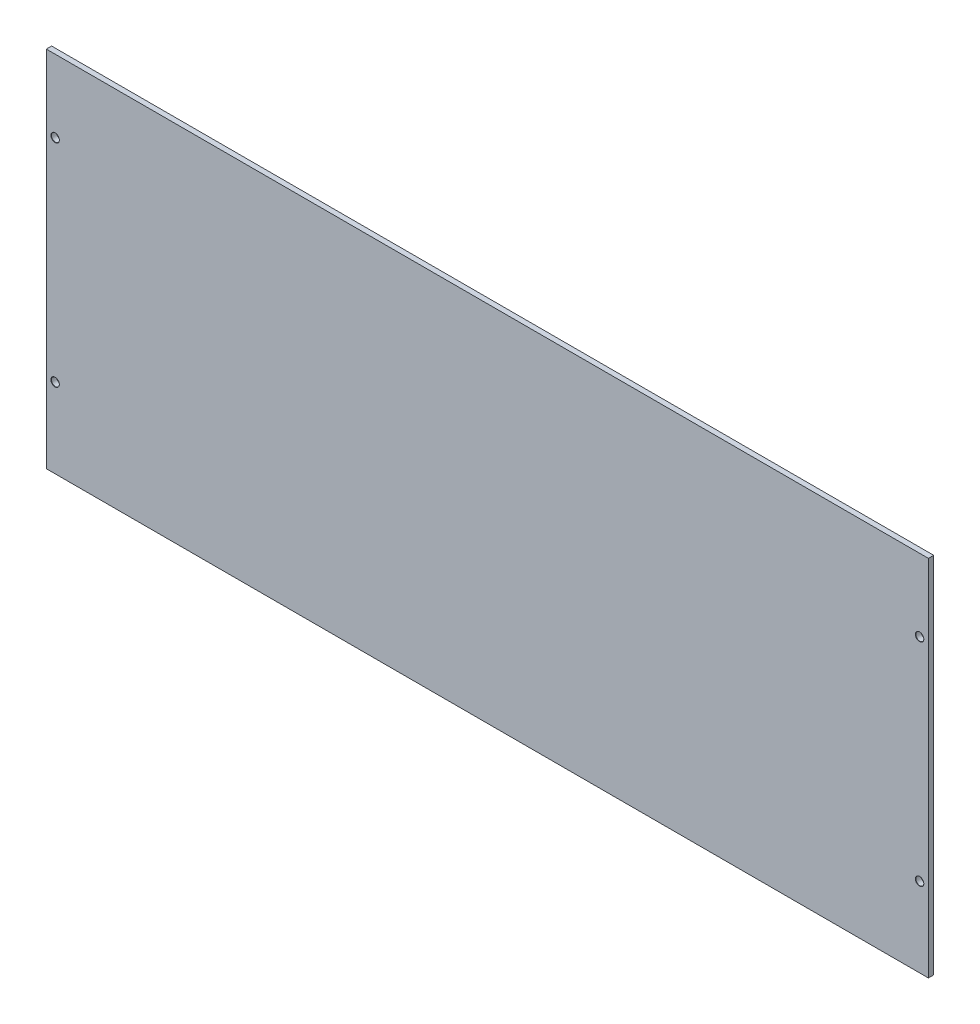
ISO-10303-21;
HEADER;
FILE_DESCRIPTION(('STEP AP214'),'2;1');
FILE_NAME('part.step','',(''),(''),'','','');
FILE_SCHEMA(('AUTOMOTIVE_DESIGN { 1 0 10303 214 1 1 1 1 }'));
ENDSEC;
DATA;
#1=APPLICATION_CONTEXT('core data for automotive mechanical design processes');
#2=APPLICATION_PROTOCOL_DEFINITION('international standard','automotive_design',2000,#1);
#3=PRODUCT_CONTEXT('',#1,'mechanical');
#4=PRODUCT('Part','Part','',(#3));
#5=PRODUCT_RELATED_PRODUCT_CATEGORY('part','',(#4));
#6=PRODUCT_DEFINITION_FORMATION('','',#4);
#7=PRODUCT_DEFINITION_CONTEXT('part definition',#1,'design');
#8=PRODUCT_DEFINITION('design','',#6,#7);
#9=PRODUCT_DEFINITION_SHAPE('','',#8);
#10=(LENGTH_UNIT() NAMED_UNIT(*) SI_UNIT(.MILLI.,.METRE.));
#11=(NAMED_UNIT(*) PLANE_ANGLE_UNIT() SI_UNIT($,.RADIAN.));
#12=(NAMED_UNIT(*) SI_UNIT($,.STERADIAN.) SOLID_ANGLE_UNIT());
#13=UNCERTAINTY_MEASURE_WITH_UNIT(LENGTH_MEASURE(1.E-05),#10,'distance_accuracy_value','');
#14=(GEOMETRIC_REPRESENTATION_CONTEXT(3) GLOBAL_UNCERTAINTY_ASSIGNED_CONTEXT((#13)) GLOBAL_UNIT_ASSIGNED_CONTEXT((#10,
#11,#12)) REPRESENTATION_CONTEXT('',''));
#15=CARTESIAN_POINT('',(0.,0.,0.));
#16=DIRECTION('',(0.,0.,1.));
#17=DIRECTION('',(1.,0.,0.));
#18=AXIS2_PLACEMENT_3D('',#15,#16,#17);
#19=CARTESIAN_POINT('',(0.,0.,3.));
#20=DIRECTION('',(1.,0.,0.));
#21=DIRECTION('',(0.,0.,-1.));
#22=AXIS2_PLACEMENT_3D('',#19,#20,#21);
#23=PLANE('',#22);
#24=DIRECTION('',(0.,-1.,0.));
#25=VECTOR('',#24,1.);
#26=CARTESIAN_POINT('',(0.,0.,0.));
#27=LINE('',#26,#25);
#28=CARTESIAN_POINT('',(0.,206.,0.));
#29=VERTEX_POINT('',#28);
#30=CARTESIAN_POINT('',(0.,0.,0.));
#31=VERTEX_POINT('',#30);
#32=EDGE_CURVE('E97',#29,#31,#27,.T.);
#33=ORIENTED_EDGE('',*,*,#32,.T.);
#34=DIRECTION('',(0.,0.,-1.));
#35=VECTOR('',#34,1.);
#36=CARTESIAN_POINT('',(0.,0.,3.));
#37=LINE('',#36,#35);
#38=CARTESIAN_POINT('',(0.,0.,3.));
#39=VERTEX_POINT('',#38);
#40=EDGE_CURVE('E11',#39,#31,#37,.T.);
#41=ORIENTED_EDGE('',*,*,#40,.F.);
#42=DIRECTION('',(0.,-1.,0.));
#43=VECTOR('',#42,1.);
#44=CARTESIAN_POINT('',(0.,0.,3.));
#45=LINE('',#44,#43);
#46=CARTESIAN_POINT('',(0.,206.,3.));
#47=VERTEX_POINT('',#46);
#48=EDGE_CURVE('E84',#47,#39,#45,.T.);
#49=ORIENTED_EDGE('',*,*,#48,.F.);
#50=DIRECTION('',(0.,0.,-1.));
#51=VECTOR('',#50,1.);
#52=CARTESIAN_POINT('',(0.,206.,3.));
#53=LINE('',#52,#51);
#54=EDGE_CURVE('E93',#47,#29,#53,.T.);
#55=ORIENTED_EDGE('',*,*,#54,.T.);
#56=EDGE_LOOP('',(#33,#41,#49,#55));
#57=FACE_BOUND('',#56,.T.);
#58=ADVANCED_FACE('F31',(#57),#23,.F.);
#59=CARTESIAN_POINT('',(0.,0.,3.));
#60=DIRECTION('',(0.,1.,0.));
#61=DIRECTION('',(0.,0.,1.));
#62=AXIS2_PLACEMENT_3D('',#59,#60,#61);
#63=PLANE('',#62);
#64=DIRECTION('',(1.,0.,0.));
#65=VECTOR('',#64,1.);
#66=CARTESIAN_POINT('',(0.,0.,0.));
#67=LINE('',#66,#65);
#68=CARTESIAN_POINT('',(500.,0.,0.));
#69=VERTEX_POINT('',#68);
#70=EDGE_CURVE('E88',#31,#69,#67,.T.);
#71=ORIENTED_EDGE('',*,*,#70,.T.);
#72=DIRECTION('',(0.,0.,-1.));
#73=VECTOR('',#72,1.);
#74=CARTESIAN_POINT('',(500.,0.,3.));
#75=LINE('',#74,#73);
#76=CARTESIAN_POINT('',(500.,0.,3.));
#77=VERTEX_POINT('',#76);
#78=EDGE_CURVE('E40',#77,#69,#75,.T.);
#79=ORIENTED_EDGE('',*,*,#78,.F.);
#80=DIRECTION('',(1.,0.,0.));
#81=VECTOR('',#80,1.);
#82=CARTESIAN_POINT('',(0.,0.,3.));
#83=LINE('',#82,#81);
#84=EDGE_CURVE('E79',#39,#77,#83,.T.);
#85=ORIENTED_EDGE('',*,*,#84,.F.);
#86=ORIENTED_EDGE('',*,*,#40,.T.);
#87=EDGE_LOOP('',(#71,#79,#85,#86));
#88=FACE_BOUND('',#87,.T.);
#89=ADVANCED_FACE('F87',(#88),#63,.F.);
#90=CARTESIAN_POINT('',(500.,0.,3.));
#91=DIRECTION('',(-1.,0.,0.));
#92=DIRECTION('',(0.,0.,1.));
#93=AXIS2_PLACEMENT_3D('',#90,#91,#92);
#94=PLANE('',#93);
#95=DIRECTION('',(0.,1.,0.));
#96=VECTOR('',#95,1.);
#97=CARTESIAN_POINT('',(500.,0.,0.));
#98=LINE('',#97,#96);
#99=CARTESIAN_POINT('',(500.,206.,0.));
#100=VERTEX_POINT('',#99);
#101=EDGE_CURVE('E66',#69,#100,#98,.T.);
#102=ORIENTED_EDGE('',*,*,#101,.T.);
#103=DIRECTION('',(0.,0.,-1.));
#104=VECTOR('',#103,1.);
#105=CARTESIAN_POINT('',(500.,206.,3.));
#106=LINE('',#105,#104);
#107=CARTESIAN_POINT('',(500.,206.,3.));
#108=VERTEX_POINT('',#107);
#109=EDGE_CURVE('E89',#108,#100,#106,.T.);
#110=ORIENTED_EDGE('',*,*,#109,.F.);
#111=DIRECTION('',(0.,1.,0.));
#112=VECTOR('',#111,1.);
#113=CARTESIAN_POINT('',(500.,0.,3.));
#114=LINE('',#113,#112);
#115=EDGE_CURVE('E82',#77,#108,#114,.T.);
#116=ORIENTED_EDGE('',*,*,#115,.F.);
#117=ORIENTED_EDGE('',*,*,#78,.T.);
#118=EDGE_LOOP('',(#102,#110,#116,#117));
#119=FACE_BOUND('',#118,.T.);
#120=ADVANCED_FACE('F91',(#119),#94,.F.);
#121=CARTESIAN_POINT('',(0.,206.,3.));
#122=DIRECTION('',(0.,-1.,0.));
#123=DIRECTION('',(0.,0.,-1.));
#124=AXIS2_PLACEMENT_3D('',#121,#122,#123);
#125=PLANE('',#124);
#126=DIRECTION('',(-1.,0.,0.));
#127=VECTOR('',#126,1.);
#128=CARTESIAN_POINT('',(0.,206.,0.));
#129=LINE('',#128,#127);
#130=EDGE_CURVE('E72',#100,#29,#129,.T.);
#131=ORIENTED_EDGE('',*,*,#130,.T.);
#132=ORIENTED_EDGE('',*,*,#54,.F.);
#133=DIRECTION('',(-1.,0.,0.));
#134=VECTOR('',#133,1.);
#135=CARTESIAN_POINT('',(0.,206.,3.));
#136=LINE('',#135,#134);
#137=EDGE_CURVE('E49',#108,#47,#136,.T.);
#138=ORIENTED_EDGE('',*,*,#137,.F.);
#139=ORIENTED_EDGE('',*,*,#109,.T.);
#140=EDGE_LOOP('',(#131,#132,#138,#139));
#141=FACE_BOUND('',#140,.T.);
#142=ADVANCED_FACE('F148',(#141),#125,.F.);
#143=CARTESIAN_POINT('',(0.,206.,3.));
#144=DIRECTION('',(0.,0.,-1.));
#145=DIRECTION('',(-1.,0.,0.));
#146=AXIS2_PLACEMENT_3D('',#143,#144,#145);
#147=PLANE('',#146);
#148=CARTESIAN_POINT('',(5.,165.,3.));
#149=DIRECTION('',(0.,0.,1.));
#150=DIRECTION('',(1.,0.,0.));
#151=AXIS2_PLACEMENT_3D('',#148,#149,#150);
#152=CIRCLE('',#151,2.4);
#153=CARTESIAN_POINT('',(7.4,165.,3.));
#154=VERTEX_POINT('',#153);
#155=EDGE_CURVE('E269',#154,#154,#152,.T.);
#156=ORIENTED_EDGE('',*,*,#155,.F.);
#157=EDGE_LOOP('',(#156));
#158=FACE_BOUND('',#157,.T.);
#159=CARTESIAN_POINT('',(5.,45.,3.));
#160=DIRECTION('',(0.,0.,1.));
#161=DIRECTION('',(1.,0.,0.));
#162=AXIS2_PLACEMENT_3D('',#159,#160,#161);
#163=CIRCLE('',#162,2.4);
#164=CARTESIAN_POINT('',(7.4,45.,3.));
#165=VERTEX_POINT('',#164);
#166=EDGE_CURVE('E122',#165,#165,#163,.T.);
#167=ORIENTED_EDGE('',*,*,#166,.F.);
#168=EDGE_LOOP('',(#167));
#169=FACE_BOUND('',#168,.T.);
#170=CARTESIAN_POINT('',(495.,45.,3.));
#171=DIRECTION('',(0.,0.,1.));
#172=DIRECTION('',(1.,0.,0.));
#173=AXIS2_PLACEMENT_3D('',#170,#171,#172);
#174=CIRCLE('',#173,2.40000000000001);
#175=CARTESIAN_POINT('',(497.4,45.,3.));
#176=VERTEX_POINT('',#175);
#177=EDGE_CURVE('E115',#176,#176,#174,.T.);
#178=ORIENTED_EDGE('',*,*,#177,.F.);
#179=EDGE_LOOP('',(#178));
#180=FACE_BOUND('',#179,.T.);
#181=CARTESIAN_POINT('',(495.,165.,3.));
#182=DIRECTION('',(0.,0.,1.));
#183=DIRECTION('',(1.,0.,0.));
#184=AXIS2_PLACEMENT_3D('',#181,#182,#183);
#185=CIRCLE('',#184,2.40000000000001);
#186=CARTESIAN_POINT('',(497.4,165.,3.));
#187=VERTEX_POINT('',#186);
#188=EDGE_CURVE('E111',#187,#187,#185,.T.);
#189=ORIENTED_EDGE('',*,*,#188,.F.);
#190=EDGE_LOOP('',(#189));
#191=FACE_BOUND('',#190,.T.);
#192=ORIENTED_EDGE('',*,*,#48,.T.);
#193=ORIENTED_EDGE('',*,*,#84,.T.);
#194=ORIENTED_EDGE('',*,*,#115,.T.);
#195=ORIENTED_EDGE('',*,*,#137,.T.);
#196=EDGE_LOOP('',(#192,#193,#194,#195));
#197=FACE_BOUND('',#196,.T.);
#198=ADVANCED_FACE('F80',(#158,#169,#180,#191,#197),#147,.F.);
#199=CARTESIAN_POINT('',(0.,206.,0.));
#200=DIRECTION('',(0.,0.,-1.));
#201=DIRECTION('',(-1.,0.,0.));
#202=AXIS2_PLACEMENT_3D('',#199,#200,#201);
#203=PLANE('',#202);
#204=CARTESIAN_POINT('',(5.,165.,0.));
#205=DIRECTION('',(0.,0.,-1.));
#206=DIRECTION('',(-1.,0.,0.));
#207=AXIS2_PLACEMENT_3D('',#204,#205,#206);
#208=CIRCLE('',#207,2.24999999999999);
#209=CARTESIAN_POINT('',(2.75000000000001,165.,0.));
#210=VERTEX_POINT('',#209);
#211=EDGE_CURVE('E34',#210,#210,#208,.T.);
#212=ORIENTED_EDGE('',*,*,#211,.F.);
#213=EDGE_LOOP('',(#212));
#214=FACE_BOUND('',#213,.T.);
#215=CARTESIAN_POINT('',(5.,45.,0.));
#216=DIRECTION('',(0.,0.,-1.));
#217=DIRECTION('',(-1.,0.,0.));
#218=AXIS2_PLACEMENT_3D('',#215,#216,#217);
#219=CIRCLE('',#218,2.24999999999999);
#220=CARTESIAN_POINT('',(2.75000000000001,45.,0.));
#221=VERTEX_POINT('',#220);
#222=EDGE_CURVE('E113',#221,#221,#219,.T.);
#223=ORIENTED_EDGE('',*,*,#222,.F.);
#224=EDGE_LOOP('',(#223));
#225=FACE_BOUND('',#224,.T.);
#226=CARTESIAN_POINT('',(495.,45.,0.));
#227=DIRECTION('',(0.,0.,-1.));
#228=DIRECTION('',(-1.,0.,0.));
#229=AXIS2_PLACEMENT_3D('',#226,#227,#228);
#230=CIRCLE('',#229,2.24999999999997);
#231=CARTESIAN_POINT('',(492.75,45.,0.));
#232=VERTEX_POINT('',#231);
#233=EDGE_CURVE('E109',#232,#232,#230,.T.);
#234=ORIENTED_EDGE('',*,*,#233,.F.);
#235=EDGE_LOOP('',(#234));
#236=FACE_BOUND('',#235,.T.);
#237=CARTESIAN_POINT('',(495.,165.,0.));
#238=DIRECTION('',(0.,0.,-1.));
#239=DIRECTION('',(-1.,0.,0.));
#240=AXIS2_PLACEMENT_3D('',#237,#238,#239);
#241=CIRCLE('',#240,2.24999999999997);
#242=CARTESIAN_POINT('',(492.75,165.,0.));
#243=VERTEX_POINT('',#242);
#244=EDGE_CURVE('E100',#243,#243,#241,.T.);
#245=ORIENTED_EDGE('',*,*,#244,.F.);
#246=EDGE_LOOP('',(#245));
#247=FACE_BOUND('',#246,.T.);
#248=ORIENTED_EDGE('',*,*,#32,.F.);
#249=ORIENTED_EDGE('',*,*,#130,.F.);
#250=ORIENTED_EDGE('',*,*,#101,.F.);
#251=ORIENTED_EDGE('',*,*,#70,.F.);
#252=EDGE_LOOP('',(#248,#249,#250,#251));
#253=FACE_BOUND('',#252,.T.);
#254=ADVANCED_FACE('F147',(#214,#225,#236,#247,#253),#203,.T.);
#255=CARTESIAN_POINT('',(495.,165.,3.));
#256=DIRECTION('',(0.,0.,1.));
#257=DIRECTION('',(1.,0.,0.));
#258=AXIS2_PLACEMENT_3D('',#255,#256,#257);
#259=CYLINDRICAL_SURFACE('',#258,2.24999999999997);
#260=ORIENTED_EDGE('',*,*,#244,.T.);
#261=EDGE_LOOP('',(#260));
#262=FACE_BOUND('',#261,.T.);
#263=CARTESIAN_POINT('',(495.,165.,2.85));
#264=DIRECTION('',(0.,0.,1.));
#265=DIRECTION('',(1.,0.,0.));
#266=AXIS2_PLACEMENT_3D('',#263,#264,#265);
#267=CIRCLE('',#266,2.24999999999997);
#268=CARTESIAN_POINT('',(497.25,165.,2.85));
#269=VERTEX_POINT('',#268);
#270=EDGE_CURVE('E108',#269,#269,#267,.T.);
#271=ORIENTED_EDGE('',*,*,#270,.T.);
#272=EDGE_LOOP('',(#271));
#273=FACE_BOUND('',#272,.T.);
#274=ADVANCED_FACE('F137',(#262,#273),#259,.F.);
#275=CARTESIAN_POINT('',(495.,165.,3.));
#276=DIRECTION('',(0.,0.,1.));
#277=DIRECTION('',(1.,0.,0.));
#278=AXIS2_PLACEMENT_3D('',#275,#276,#277);
#279=CONICAL_SURFACE('',#278,2.40000000000001,0.785398163397576);
#280=ORIENTED_EDGE('',*,*,#270,.F.);
#281=EDGE_LOOP('',(#280));
#282=FACE_BOUND('',#281,.T.);
#283=ORIENTED_EDGE('',*,*,#188,.T.);
#284=EDGE_LOOP('',(#283));
#285=FACE_BOUND('',#284,.T.);
#286=ADVANCED_FACE('F139',(#282,#285),#279,.F.);
#287=CARTESIAN_POINT('',(495.,45.,3.));
#288=DIRECTION('',(0.,0.,1.));
#289=DIRECTION('',(1.,0.,0.));
#290=AXIS2_PLACEMENT_3D('',#287,#288,#289);
#291=CYLINDRICAL_SURFACE('',#290,2.24999999999997);
#292=ORIENTED_EDGE('',*,*,#233,.T.);
#293=EDGE_LOOP('',(#292));
#294=FACE_BOUND('',#293,.T.);
#295=CARTESIAN_POINT('',(495.,45.,2.85));
#296=DIRECTION('',(0.,0.,1.));
#297=DIRECTION('',(1.,0.,0.));
#298=AXIS2_PLACEMENT_3D('',#295,#296,#297);
#299=CIRCLE('',#298,2.24999999999997);
#300=CARTESIAN_POINT('',(497.25,45.,2.85));
#301=VERTEX_POINT('',#300);
#302=EDGE_CURVE('E112',#301,#301,#299,.T.);
#303=ORIENTED_EDGE('',*,*,#302,.T.);
#304=EDGE_LOOP('',(#303));
#305=FACE_BOUND('',#304,.T.);
#306=ADVANCED_FACE('F142',(#294,#305),#291,.F.);
#307=CARTESIAN_POINT('',(495.,45.,3.));
#308=DIRECTION('',(0.,0.,1.));
#309=DIRECTION('',(1.,0.,0.));
#310=AXIS2_PLACEMENT_3D('',#307,#308,#309);
#311=CONICAL_SURFACE('',#310,2.40000000000001,0.785398163397576);
#312=ORIENTED_EDGE('',*,*,#302,.F.);
#313=EDGE_LOOP('',(#312));
#314=FACE_BOUND('',#313,.T.);
#315=ORIENTED_EDGE('',*,*,#177,.T.);
#316=EDGE_LOOP('',(#315));
#317=FACE_BOUND('',#316,.T.);
#318=ADVANCED_FACE('F211',(#314,#317),#311,.F.);
#319=CARTESIAN_POINT('',(5.,45.,3.));
#320=DIRECTION('',(0.,0.,1.));
#321=DIRECTION('',(1.,0.,0.));
#322=AXIS2_PLACEMENT_3D('',#319,#320,#321);
#323=CYLINDRICAL_SURFACE('',#322,2.24999999999999);
#324=ORIENTED_EDGE('',*,*,#222,.T.);
#325=EDGE_LOOP('',(#324));
#326=FACE_BOUND('',#325,.T.);
#327=CARTESIAN_POINT('',(5.,45.,2.85));
#328=DIRECTION('',(0.,0.,1.));
#329=DIRECTION('',(1.,0.,0.));
#330=AXIS2_PLACEMENT_3D('',#327,#328,#329);
#331=CIRCLE('',#330,2.25);
#332=CARTESIAN_POINT('',(7.25,45.,2.85));
#333=VERTEX_POINT('',#332);
#334=EDGE_CURVE('E116',#333,#333,#331,.T.);
#335=ORIENTED_EDGE('',*,*,#334,.T.);
#336=EDGE_LOOP('',(#335));
#337=FACE_BOUND('',#336,.T.);
#338=ADVANCED_FACE('F221',(#326,#337),#323,.F.);
#339=CARTESIAN_POINT('',(5.,45.,3.));
#340=DIRECTION('',(0.,0.,1.));
#341=DIRECTION('',(1.,0.,0.));
#342=AXIS2_PLACEMENT_3D('',#339,#340,#341);
#343=CONICAL_SURFACE('',#342,2.4,0.785398163397445);
#344=ORIENTED_EDGE('',*,*,#334,.F.);
#345=EDGE_LOOP('',(#344));
#346=FACE_BOUND('',#345,.T.);
#347=ORIENTED_EDGE('',*,*,#166,.T.);
#348=EDGE_LOOP('',(#347));
#349=FACE_BOUND('',#348,.T.);
#350=ADVANCED_FACE('F231',(#346,#349),#343,.F.);
#351=CARTESIAN_POINT('',(5.,165.,3.));
#352=DIRECTION('',(0.,0.,1.));
#353=DIRECTION('',(1.,0.,0.));
#354=AXIS2_PLACEMENT_3D('',#351,#352,#353);
#355=CYLINDRICAL_SURFACE('',#354,2.24999999999999);
#356=ORIENTED_EDGE('',*,*,#211,.T.);
#357=EDGE_LOOP('',(#356));
#358=FACE_BOUND('',#357,.T.);
#359=CARTESIAN_POINT('',(5.,165.,2.85));
#360=DIRECTION('',(0.,0.,1.));
#361=DIRECTION('',(1.,0.,0.));
#362=AXIS2_PLACEMENT_3D('',#359,#360,#361);
#363=CIRCLE('',#362,2.25);
#364=CARTESIAN_POINT('',(7.25,165.,2.85));
#365=VERTEX_POINT('',#364);
#366=EDGE_CURVE('E267',#365,#365,#363,.T.);
#367=ORIENTED_EDGE('',*,*,#366,.T.);
#368=EDGE_LOOP('',(#367));
#369=FACE_BOUND('',#368,.T.);
#370=ADVANCED_FACE('F240',(#358,#369),#355,.F.);
#371=CARTESIAN_POINT('',(5.,165.,3.));
#372=DIRECTION('',(0.,0.,1.));
#373=DIRECTION('',(1.,0.,0.));
#374=AXIS2_PLACEMENT_3D('',#371,#372,#373);
#375=CONICAL_SURFACE('',#374,2.4,0.785398163397445);
#376=ORIENTED_EDGE('',*,*,#366,.F.);
#377=EDGE_LOOP('',(#376));
#378=FACE_BOUND('',#377,.T.);
#379=ORIENTED_EDGE('',*,*,#155,.T.);
#380=EDGE_LOOP('',(#379));
#381=FACE_BOUND('',#380,.T.);
#382=ADVANCED_FACE('F250',(#378,#381),#375,.F.);
#383=CLOSED_SHELL('',(#58,#89,#120,#142,#198,#254,#274,#286,#306,#318,#338,#350,#370,#382));
#384=MANIFOLD_SOLID_BREP('B2',#383);
#385=ADVANCED_BREP_SHAPE_REPRESENTATION('',(#18,#384),#14);
#386=SHAPE_DEFINITION_REPRESENTATION(#9,#385);
ENDSEC;
END-ISO-10303-21;
